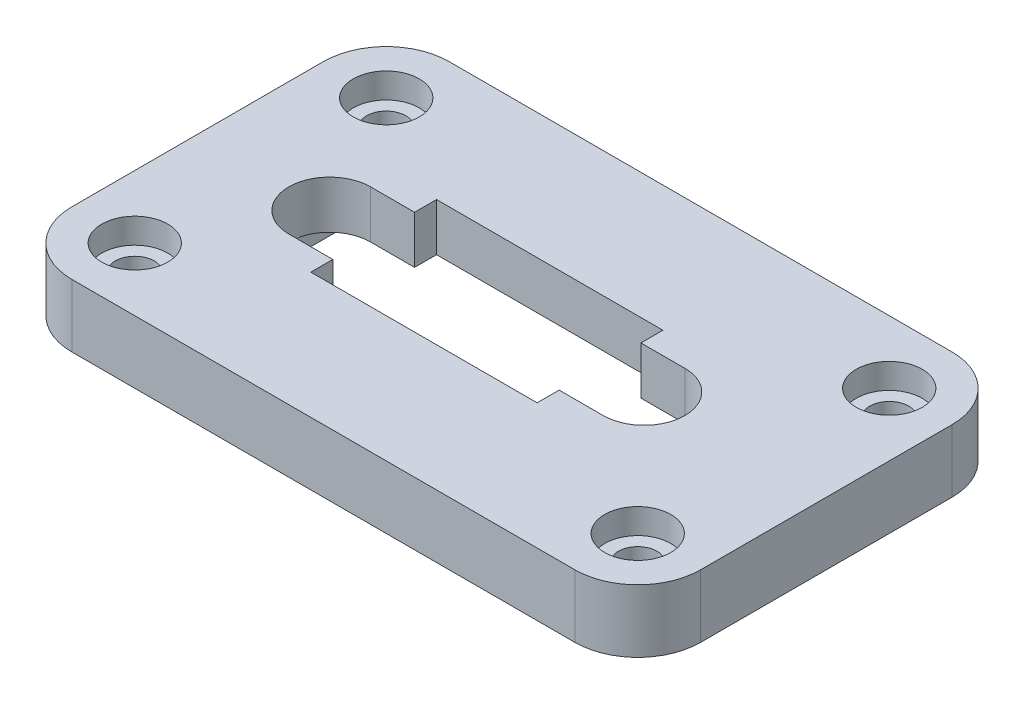
ISO-10303-21;
HEADER;
FILE_DESCRIPTION(('STEP AP214'),'2;1');
FILE_NAME('part.step','',(''),(''),'','','');
FILE_SCHEMA(('AUTOMOTIVE_DESIGN { 1 0 10303 214 1 1 1 1 }'));
ENDSEC;
DATA;
#1=APPLICATION_CONTEXT('core data for automotive mechanical design processes');
#2=APPLICATION_PROTOCOL_DEFINITION('international standard','automotive_design',2000,#1);
#3=PRODUCT_CONTEXT('',#1,'mechanical');
#4=PRODUCT('Part','Part','',(#3));
#5=PRODUCT_RELATED_PRODUCT_CATEGORY('part','',(#4));
#6=PRODUCT_DEFINITION_FORMATION('','',#4);
#7=PRODUCT_DEFINITION_CONTEXT('part definition',#1,'design');
#8=PRODUCT_DEFINITION('design','',#6,#7);
#9=PRODUCT_DEFINITION_SHAPE('','',#8);
#10=(LENGTH_UNIT() NAMED_UNIT(*) SI_UNIT(.MILLI.,.METRE.));
#11=(NAMED_UNIT(*) PLANE_ANGLE_UNIT() SI_UNIT($,.RADIAN.));
#12=(NAMED_UNIT(*) SI_UNIT($,.STERADIAN.) SOLID_ANGLE_UNIT());
#13=UNCERTAINTY_MEASURE_WITH_UNIT(LENGTH_MEASURE(1.E-05),#10,'distance_accuracy_value','');
#14=(GEOMETRIC_REPRESENTATION_CONTEXT(3) GLOBAL_UNCERTAINTY_ASSIGNED_CONTEXT((#13)) GLOBAL_UNIT_ASSIGNED_CONTEXT((#10,
#11,#12)) REPRESENTATION_CONTEXT('',''));
#15=CARTESIAN_POINT('',(0.,0.,0.));
#16=DIRECTION('',(0.,0.,1.));
#17=DIRECTION('',(1.,0.,0.));
#18=AXIS2_PLACEMENT_3D('',#15,#16,#17);
#19=CARTESIAN_POINT('',(10.5,5.,0.));
#20=DIRECTION('',(0.,-1.,0.));
#21=DIRECTION('',(0.,0.,-1.));
#22=AXIS2_PLACEMENT_3D('',#19,#20,#21);
#23=CYLINDRICAL_SURFACE('',#22,3.25);
#24=CARTESIAN_POINT('',(10.5,1.2,0.));
#25=DIRECTION('',(0.,-1.,0.));
#26=DIRECTION('',(0.,0.,-1.));
#27=AXIS2_PLACEMENT_3D('',#24,#25,#26);
#28=CIRCLE('',#27,3.25);
#29=CARTESIAN_POINT('',(10.5,1.2,-3.25));
#30=VERTEX_POINT('',#29);
#31=CARTESIAN_POINT('',(13.75,1.2,0.));
#32=VERTEX_POINT('',#31);
#33=EDGE_CURVE('E282',#30,#32,#28,.T.);
#34=ORIENTED_EDGE('',*,*,#33,.T.);
#35=CARTESIAN_POINT('',(10.5,1.2,3.25));
#36=VERTEX_POINT('',#35);
#37=EDGE_CURVE('E287',#32,#36,#28,.T.);
#38=ORIENTED_EDGE('',*,*,#37,.T.);
#39=DIRECTION('',(0.,-1.,0.));
#40=VECTOR('',#39,1.);
#41=CARTESIAN_POINT('',(10.5,5.,3.25));
#42=LINE('',#41,#40);
#43=CARTESIAN_POINT('',(10.5,5.,3.25));
#44=VERTEX_POINT('',#43);
#45=EDGE_CURVE('E470',#44,#36,#42,.T.);
#46=ORIENTED_EDGE('',*,*,#45,.F.);
#47=CARTESIAN_POINT('',(10.5,5.,0.));
#48=DIRECTION('',(0.,1.,0.));
#49=DIRECTION('',(0.,0.,1.));
#50=AXIS2_PLACEMENT_3D('',#47,#48,#49);
#51=CIRCLE('',#50,3.25);
#52=CARTESIAN_POINT('',(10.5,5.,-3.25));
#53=VERTEX_POINT('',#52);
#54=EDGE_CURVE('E339',#44,#53,#51,.T.);
#55=ORIENTED_EDGE('',*,*,#54,.T.);
#56=DIRECTION('',(0.,-1.,0.));
#57=VECTOR('',#56,1.);
#58=CARTESIAN_POINT('',(10.5,5.,-3.25));
#59=LINE('',#58,#57);
#60=EDGE_CURVE('E394',#53,#30,#59,.T.);
#61=ORIENTED_EDGE('',*,*,#60,.T.);
#62=EDGE_LOOP('',(#34,#38,#46,#55,#61));
#63=FACE_BOUND('',#62,.T.);
#64=ADVANCED_FACE('F41',(#63),#23,.F.);
#65=CARTESIAN_POINT('',(0.,5.,3.25));
#66=DIRECTION('',(0.,0.,1.));
#67=DIRECTION('',(1.,0.,0.));
#68=AXIS2_PLACEMENT_3D('',#65,#66,#67);
#69=PLANE('',#68);
#70=DIRECTION('',(1.,0.,0.));
#71=VECTOR('',#70,1.);
#72=CARTESIAN_POINT('',(0.,1.2,3.25));
#73=LINE('',#72,#71);
#74=CARTESIAN_POINT('',(7.,1.2,3.25));
#75=VERTEX_POINT('',#74);
#76=EDGE_CURVE('E303',#75,#36,#73,.T.);
#77=ORIENTED_EDGE('',*,*,#76,.F.);
#78=DIRECTION('',(0.,-1.,0.));
#79=VECTOR('',#78,1.);
#80=CARTESIAN_POINT('',(7.,5.,3.25));
#81=LINE('',#80,#79);
#82=CARTESIAN_POINT('',(7.,5.,3.25));
#83=VERTEX_POINT('',#82);
#84=EDGE_CURVE('E466',#83,#75,#81,.T.);
#85=ORIENTED_EDGE('',*,*,#84,.F.);
#86=DIRECTION('',(-1.,0.,0.));
#87=VECTOR('',#86,1.);
#88=CARTESIAN_POINT('',(0.,5.,3.25));
#89=LINE('',#88,#87);
#90=EDGE_CURVE('E343',#44,#83,#89,.T.);
#91=ORIENTED_EDGE('',*,*,#90,.F.);
#92=ORIENTED_EDGE('',*,*,#45,.T.);
#93=EDGE_LOOP('',(#77,#85,#91,#92));
#94=FACE_BOUND('',#93,.T.);
#95=ADVANCED_FACE('F578',(#94),#69,.F.);
#96=CARTESIAN_POINT('',(7.,5.,0.));
#97=DIRECTION('',(-1.,0.,0.));
#98=DIRECTION('',(0.,0.,1.));
#99=AXIS2_PLACEMENT_3D('',#96,#97,#98);
#100=PLANE('',#99);
#101=ORIENTED_EDGE('',*,*,#84,.T.);
#102=DIRECTION('',(0.,0.,1.));
#103=VECTOR('',#102,1.);
#104=CARTESIAN_POINT('',(7.,1.2,0.));
#105=LINE('',#104,#103);
#106=CARTESIAN_POINT('',(7.,1.2,5.));
#107=VERTEX_POINT('',#106);
#108=EDGE_CURVE('E299',#75,#107,#105,.T.);
#109=ORIENTED_EDGE('',*,*,#108,.T.);
#110=DIRECTION('',(0.,-1.,0.));
#111=VECTOR('',#110,1.);
#112=CARTESIAN_POINT('',(7.,5.,5.));
#113=LINE('',#112,#111);
#114=CARTESIAN_POINT('',(7.,5.,5.));
#115=VERTEX_POINT('',#114);
#116=EDGE_CURVE('E462',#115,#107,#113,.T.);
#117=ORIENTED_EDGE('',*,*,#116,.F.);
#118=DIRECTION('',(0.,0.,-1.));
#119=VECTOR('',#118,1.);
#120=CARTESIAN_POINT('',(7.,5.,0.));
#121=LINE('',#120,#119);
#122=EDGE_CURVE('E347',#115,#83,#121,.T.);
#123=ORIENTED_EDGE('',*,*,#122,.T.);
#124=EDGE_LOOP('',(#101,#109,#117,#123));
#125=FACE_BOUND('',#124,.T.);
#126=ADVANCED_FACE('F584',(#125),#100,.T.);
#127=CARTESIAN_POINT('',(0.,5.,5.));
#128=DIRECTION('',(0.,0.,-1.));
#129=DIRECTION('',(-1.,0.,0.));
#130=AXIS2_PLACEMENT_3D('',#127,#128,#129);
#131=PLANE('',#130);
#132=ORIENTED_EDGE('',*,*,#116,.T.);
#133=DIRECTION('',(-1.,0.,0.));
#134=VECTOR('',#133,1.);
#135=CARTESIAN_POINT('',(0.,1.2,5.));
#136=LINE('',#135,#134);
#137=CARTESIAN_POINT('',(-11.,1.2,5.));
#138=VERTEX_POINT('',#137);
#139=EDGE_CURVE('E295',#107,#138,#136,.T.);
#140=ORIENTED_EDGE('',*,*,#139,.T.);
#141=DIRECTION('',(0.,-1.,0.));
#142=VECTOR('',#141,1.);
#143=CARTESIAN_POINT('',(-11.,5.,5.));
#144=LINE('',#143,#142);
#145=CARTESIAN_POINT('',(-11.,5.,5.));
#146=VERTEX_POINT('',#145);
#147=EDGE_CURVE('E458',#146,#138,#144,.T.);
#148=ORIENTED_EDGE('',*,*,#147,.F.);
#149=DIRECTION('',(1.,0.,0.));
#150=VECTOR('',#149,1.);
#151=CARTESIAN_POINT('',(0.,5.,5.));
#152=LINE('',#151,#150);
#153=EDGE_CURVE('E351',#146,#115,#152,.T.);
#154=ORIENTED_EDGE('',*,*,#153,.T.);
#155=EDGE_LOOP('',(#132,#140,#148,#154));
#156=FACE_BOUND('',#155,.T.);
#157=ADVANCED_FACE('F698',(#156),#131,.T.);
#158=CARTESIAN_POINT('',(-11.,5.,0.));
#159=DIRECTION('',(-1.,0.,0.));
#160=DIRECTION('',(0.,0.,1.));
#161=AXIS2_PLACEMENT_3D('',#158,#159,#160);
#162=PLANE('',#161);
#163=DIRECTION('',(0.,0.,1.));
#164=VECTOR('',#163,1.);
#165=CARTESIAN_POINT('',(-11.,1.2,0.));
#166=LINE('',#165,#164);
#167=CARTESIAN_POINT('',(-11.,1.2,3.25));
#168=VERTEX_POINT('',#167);
#169=EDGE_CURVE('E292',#168,#138,#166,.T.);
#170=ORIENTED_EDGE('',*,*,#169,.F.);
#171=DIRECTION('',(0.,-1.,0.));
#172=VECTOR('',#171,1.);
#173=CARTESIAN_POINT('',(-11.,5.,3.25));
#174=LINE('',#173,#172);
#175=CARTESIAN_POINT('',(-11.,5.,3.25));
#176=VERTEX_POINT('',#175);
#177=EDGE_CURVE('E454',#176,#168,#174,.T.);
#178=ORIENTED_EDGE('',*,*,#177,.F.);
#179=DIRECTION('',(0.,0.,-1.));
#180=VECTOR('',#179,1.);
#181=CARTESIAN_POINT('',(-11.,5.,0.));
#182=LINE('',#181,#180);
#183=EDGE_CURVE('E356',#146,#176,#182,.T.);
#184=ORIENTED_EDGE('',*,*,#183,.F.);
#185=ORIENTED_EDGE('',*,*,#147,.T.);
#186=EDGE_LOOP('',(#170,#178,#184,#185));
#187=FACE_BOUND('',#186,.T.);
#188=ADVANCED_FACE('F708',(#187),#162,.F.);
#189=CARTESIAN_POINT('',(0.,5.,3.25));
#190=DIRECTION('',(0.,0.,-1.));
#191=DIRECTION('',(-1.,0.,0.));
#192=AXIS2_PLACEMENT_3D('',#189,#190,#191);
#193=PLANE('',#192);
#194=ORIENTED_EDGE('',*,*,#177,.T.);
#195=DIRECTION('',(-1.,0.,0.));
#196=VECTOR('',#195,1.);
#197=CARTESIAN_POINT('',(0.,1.2,3.25));
#198=LINE('',#197,#196);
#199=CARTESIAN_POINT('',(-14.5,1.2,3.25));
#200=VERTEX_POINT('',#199);
#201=EDGE_CURVE('E288',#168,#200,#198,.T.);
#202=ORIENTED_EDGE('',*,*,#201,.T.);
#203=DIRECTION('',(0.,-1.,0.));
#204=VECTOR('',#203,1.);
#205=CARTESIAN_POINT('',(-14.5,5.,3.25));
#206=LINE('',#205,#204);
#207=CARTESIAN_POINT('',(-14.5,5.,3.25));
#208=VERTEX_POINT('',#207);
#209=EDGE_CURVE('E450',#208,#200,#206,.T.);
#210=ORIENTED_EDGE('',*,*,#209,.F.);
#211=DIRECTION('',(1.,0.,0.));
#212=VECTOR('',#211,1.);
#213=CARTESIAN_POINT('',(0.,5.,3.25));
#214=LINE('',#213,#212);
#215=EDGE_CURVE('E359',#208,#176,#214,.T.);
#216=ORIENTED_EDGE('',*,*,#215,.T.);
#217=EDGE_LOOP('',(#194,#202,#210,#216));
#218=FACE_BOUND('',#217,.T.);
#219=ADVANCED_FACE('F716',(#218),#193,.T.);
#220=CARTESIAN_POINT('',(-14.5,5.,0.));
#221=DIRECTION('',(0.,-1.,0.));
#222=DIRECTION('',(0.,0.,-1.));
#223=AXIS2_PLACEMENT_3D('',#220,#221,#222);
#224=CYLINDRICAL_SURFACE('',#223,3.25);
#225=CARTESIAN_POINT('',(-14.5,1.2,0.));
#226=DIRECTION('',(0.,-1.,0.));
#227=DIRECTION('',(0.,0.,-1.));
#228=AXIS2_PLACEMENT_3D('',#225,#226,#227);
#229=CIRCLE('',#228,3.25);
#230=CARTESIAN_POINT('',(-17.75,1.2,0.));
#231=VERTEX_POINT('',#230);
#232=EDGE_CURVE('E283',#200,#231,#229,.T.);
#233=ORIENTED_EDGE('',*,*,#232,.T.);
#234=CARTESIAN_POINT('',(-14.5,1.2,-3.25));
#235=VERTEX_POINT('',#234);
#236=EDGE_CURVE('E217',#231,#235,#229,.T.);
#237=ORIENTED_EDGE('',*,*,#236,.T.);
#238=DIRECTION('',(0.,-1.,0.));
#239=VECTOR('',#238,1.);
#240=CARTESIAN_POINT('',(-14.5,5.,-3.25));
#241=LINE('',#240,#239);
#242=CARTESIAN_POINT('',(-14.5,5.,-3.25));
#243=VERTEX_POINT('',#242);
#244=EDGE_CURVE('E446',#243,#235,#241,.T.);
#245=ORIENTED_EDGE('',*,*,#244,.F.);
#246=CARTESIAN_POINT('',(-14.5,5.,0.));
#247=DIRECTION('',(0.,1.,0.));
#248=DIRECTION('',(0.,0.,1.));
#249=AXIS2_PLACEMENT_3D('',#246,#247,#248);
#250=CIRCLE('',#249,3.25);
#251=EDGE_CURVE('E364',#243,#208,#250,.T.);
#252=ORIENTED_EDGE('',*,*,#251,.T.);
#253=ORIENTED_EDGE('',*,*,#209,.T.);
#254=EDGE_LOOP('',(#233,#237,#245,#252,#253));
#255=FACE_BOUND('',#254,.T.);
#256=ADVANCED_FACE('F726',(#255),#224,.F.);
#257=CARTESIAN_POINT('',(0.,5.,-3.25));
#258=DIRECTION('',(0.,0.,-1.));
#259=DIRECTION('',(-1.,0.,0.));
#260=AXIS2_PLACEMENT_3D('',#257,#258,#259);
#261=PLANE('',#260);
#262=DIRECTION('',(-1.,0.,0.));
#263=VECTOR('',#262,1.);
#264=CARTESIAN_POINT('',(0.,1.2,-3.25));
#265=LINE('',#264,#263);
#266=CARTESIAN_POINT('',(-11.,1.2,-3.25));
#267=VERTEX_POINT('',#266);
#268=EDGE_CURVE('E277',#267,#235,#265,.T.);
#269=ORIENTED_EDGE('',*,*,#268,.F.);
#270=DIRECTION('',(0.,-1.,0.));
#271=VECTOR('',#270,1.);
#272=CARTESIAN_POINT('',(-11.,5.,-3.25));
#273=LINE('',#272,#271);
#274=CARTESIAN_POINT('',(-11.,5.,-3.25));
#275=VERTEX_POINT('',#274);
#276=EDGE_CURVE('E442',#275,#267,#273,.T.);
#277=ORIENTED_EDGE('',*,*,#276,.F.);
#278=DIRECTION('',(1.,0.,0.));
#279=VECTOR('',#278,1.);
#280=CARTESIAN_POINT('',(0.,5.,-3.25));
#281=LINE('',#280,#279);
#282=EDGE_CURVE('E368',#243,#275,#281,.T.);
#283=ORIENTED_EDGE('',*,*,#282,.F.);
#284=ORIENTED_EDGE('',*,*,#244,.T.);
#285=EDGE_LOOP('',(#269,#277,#283,#284));
#286=FACE_BOUND('',#285,.T.);
#287=ADVANCED_FACE('F735',(#286),#261,.F.);
#288=DIRECTION('',(0.,0.,1.));
#289=VECTOR('',#288,1.);
#290=CARTESIAN_POINT('',(-11.,1.2,0.));
#291=LINE('',#290,#289);
#292=CARTESIAN_POINT('',(-11.,1.2,-5.));
#293=VERTEX_POINT('',#292);
#294=EDGE_CURVE('E274',#293,#267,#291,.T.);
#295=ORIENTED_EDGE('',*,*,#294,.F.);
#296=DIRECTION('',(0.,-1.,0.));
#297=VECTOR('',#296,1.);
#298=CARTESIAN_POINT('',(-11.,5.,-5.));
#299=LINE('',#298,#297);
#300=CARTESIAN_POINT('',(-11.,5.,-5.));
#301=VERTEX_POINT('',#300);
#302=EDGE_CURVE('E438',#301,#293,#299,.T.);
#303=ORIENTED_EDGE('',*,*,#302,.F.);
#304=EDGE_CURVE('E360',#275,#301,#182,.T.);
#305=ORIENTED_EDGE('',*,*,#304,.F.);
#306=ORIENTED_EDGE('',*,*,#276,.T.);
#307=EDGE_LOOP('',(#295,#303,#305,#306));
#308=FACE_BOUND('',#307,.T.);
#309=ADVANCED_FACE('F719',(#308),#162,.F.);
#310=CARTESIAN_POINT('',(0.,5.,-5.));
#311=DIRECTION('',(0.,0.,-1.));
#312=DIRECTION('',(-1.,0.,0.));
#313=AXIS2_PLACEMENT_3D('',#310,#311,#312);
#314=PLANE('',#313);
#315=DIRECTION('',(-1.,0.,0.));
#316=VECTOR('',#315,1.);
#317=CARTESIAN_POINT('',(0.,1.2,-5.));
#318=LINE('',#317,#316);
#319=CARTESIAN_POINT('',(7.,1.2,-5.));
#320=VERTEX_POINT('',#319);
#321=EDGE_CURVE('E271',#320,#293,#318,.T.);
#322=ORIENTED_EDGE('',*,*,#321,.F.);
#323=DIRECTION('',(0.,-1.,0.));
#324=VECTOR('',#323,1.);
#325=CARTESIAN_POINT('',(7.,5.,-5.));
#326=LINE('',#325,#324);
#327=CARTESIAN_POINT('',(7.,5.,-5.));
#328=VERTEX_POINT('',#327);
#329=EDGE_CURVE('E434',#328,#320,#326,.T.);
#330=ORIENTED_EDGE('',*,*,#329,.F.);
#331=DIRECTION('',(1.,0.,0.));
#332=VECTOR('',#331,1.);
#333=CARTESIAN_POINT('',(0.,5.,-5.));
#334=LINE('',#333,#332);
#335=EDGE_CURVE('E372',#301,#328,#334,.T.);
#336=ORIENTED_EDGE('',*,*,#335,.F.);
#337=ORIENTED_EDGE('',*,*,#302,.T.);
#338=EDGE_LOOP('',(#322,#330,#336,#337));
#339=FACE_BOUND('',#338,.T.);
#340=ADVANCED_FACE('F752',(#339),#314,.F.);
#341=ORIENTED_EDGE('',*,*,#329,.T.);
#342=DIRECTION('',(0.,0.,1.));
#343=VECTOR('',#342,1.);
#344=CARTESIAN_POINT('',(7.,1.2,0.));
#345=LINE('',#344,#343);
#346=CARTESIAN_POINT('',(7.,1.2,-3.25));
#347=VERTEX_POINT('',#346);
#348=EDGE_CURVE('E261',#320,#347,#345,.T.);
#349=ORIENTED_EDGE('',*,*,#348,.T.);
#350=DIRECTION('',(0.,-1.,0.));
#351=VECTOR('',#350,1.);
#352=CARTESIAN_POINT('',(7.,5.,-3.25));
#353=LINE('',#352,#351);
#354=CARTESIAN_POINT('',(7.,5.,-3.25));
#355=VERTEX_POINT('',#354);
#356=EDGE_CURVE('E430',#355,#347,#353,.T.);
#357=ORIENTED_EDGE('',*,*,#356,.F.);
#358=EDGE_CURVE('E352',#355,#328,#121,.T.);
#359=ORIENTED_EDGE('',*,*,#358,.T.);
#360=EDGE_LOOP('',(#341,#349,#357,#359));
#361=FACE_BOUND('',#360,.T.);
#362=ADVANCED_FACE('F701',(#361),#100,.T.);
#363=CARTESIAN_POINT('',(0.,5.,-3.25));
#364=DIRECTION('',(0.,0.,1.));
#365=DIRECTION('',(1.,0.,0.));
#366=AXIS2_PLACEMENT_3D('',#363,#364,#365);
#367=PLANE('',#366);
#368=ORIENTED_EDGE('',*,*,#356,.T.);
#369=DIRECTION('',(1.,0.,0.));
#370=VECTOR('',#369,1.);
#371=CARTESIAN_POINT('',(0.,1.2,-3.25));
#372=LINE('',#371,#370);
#373=EDGE_CURVE('E493',#347,#30,#372,.T.);
#374=ORIENTED_EDGE('',*,*,#373,.T.);
#375=ORIENTED_EDGE('',*,*,#60,.F.);
#376=DIRECTION('',(-1.,0.,0.));
#377=VECTOR('',#376,1.);
#378=CARTESIAN_POINT('',(0.,5.,-3.25));
#379=LINE('',#378,#377);
#380=EDGE_CURVE('E375',#53,#355,#379,.T.);
#381=ORIENTED_EDGE('',*,*,#380,.T.);
#382=EDGE_LOOP('',(#368,#374,#375,#381));
#383=FACE_BOUND('',#382,.T.);
#384=ADVANCED_FACE('F593',(#383),#367,.T.);
#385=CARTESIAN_POINT('',(-20.,5.,-10.));
#386=DIRECTION('',(0.,-1.,0.));
#387=DIRECTION('',(0.,0.,-1.));
#388=AXIS2_PLACEMENT_3D('',#385,#386,#387);
#389=CYLINDRICAL_SURFACE('',#388,1.55);
#390=CARTESIAN_POINT('',(-20.,0.,-10.));
#391=DIRECTION('',(0.,1.,0.));
#392=DIRECTION('',(0.,0.,1.));
#393=AXIS2_PLACEMENT_3D('',#390,#391,#392);
#394=CIRCLE('',#393,1.55);
#395=CARTESIAN_POINT('',(-20.,0.,-8.45));
#396=VERTEX_POINT('',#395);
#397=EDGE_CURVE('E408',#396,#396,#394,.T.);
#398=ORIENTED_EDGE('',*,*,#397,.F.);
#399=EDGE_LOOP('',(#398));
#400=FACE_BOUND('',#399,.T.);
#401=CARTESIAN_POINT('',(-20.,3.,-10.));
#402=DIRECTION('',(0.,1.,0.));
#403=DIRECTION('',(0.,0.,1.));
#404=AXIS2_PLACEMENT_3D('',#401,#402,#403);
#405=CIRCLE('',#404,1.55);
#406=CARTESIAN_POINT('',(-20.,3.,-8.45));
#407=VERTEX_POINT('',#406);
#408=EDGE_CURVE('E400',#407,#407,#405,.T.);
#409=ORIENTED_EDGE('',*,*,#408,.T.);
#410=EDGE_LOOP('',(#409));
#411=FACE_BOUND('',#410,.T.);
#412=ADVANCED_FACE('F589',(#400,#411),#389,.F.);
#413=CARTESIAN_POINT('',(-20.,5.,10.));
#414=DIRECTION('',(0.,-1.,0.));
#415=DIRECTION('',(0.,0.,-1.));
#416=AXIS2_PLACEMENT_3D('',#413,#414,#415);
#417=CYLINDRICAL_SURFACE('',#416,1.55);
#418=CARTESIAN_POINT('',(-20.,0.,10.));
#419=DIRECTION('',(0.,1.,0.));
#420=DIRECTION('',(0.,0.,1.));
#421=AXIS2_PLACEMENT_3D('',#418,#419,#420);
#422=CIRCLE('',#421,1.55);
#423=CARTESIAN_POINT('',(-20.,0.,11.55));
#424=VERTEX_POINT('',#423);
#425=EDGE_CURVE('E404',#424,#424,#422,.T.);
#426=ORIENTED_EDGE('',*,*,#425,.F.);
#427=EDGE_LOOP('',(#426));
#428=FACE_BOUND('',#427,.T.);
#429=CARTESIAN_POINT('',(-20.,3.,10.));
#430=DIRECTION('',(0.,1.,0.));
#431=DIRECTION('',(0.,0.,1.));
#432=AXIS2_PLACEMENT_3D('',#429,#430,#431);
#433=CIRCLE('',#432,1.55);
#434=CARTESIAN_POINT('',(-20.,3.,11.55));
#435=VERTEX_POINT('',#434);
#436=EDGE_CURVE('E482',#435,#435,#433,.T.);
#437=ORIENTED_EDGE('',*,*,#436,.T.);
#438=EDGE_LOOP('',(#437));
#439=FACE_BOUND('',#438,.T.);
#440=ADVANCED_FACE('F592',(#428,#439),#417,.F.);
#441=CARTESIAN_POINT('',(20.,5.,10.));
#442=DIRECTION('',(0.,-1.,0.));
#443=DIRECTION('',(0.,0.,-1.));
#444=AXIS2_PLACEMENT_3D('',#441,#442,#443);
#445=CYLINDRICAL_SURFACE('',#444,1.55);
#446=CARTESIAN_POINT('',(20.,0.,10.));
#447=DIRECTION('',(0.,1.,0.));
#448=DIRECTION('',(0.,0.,1.));
#449=AXIS2_PLACEMENT_3D('',#446,#447,#448);
#450=CIRCLE('',#449,1.55);
#451=CARTESIAN_POINT('',(20.,0.,11.55));
#452=VERTEX_POINT('',#451);
#453=EDGE_CURVE('E399',#452,#452,#450,.T.);
#454=ORIENTED_EDGE('',*,*,#453,.F.);
#455=EDGE_LOOP('',(#454));
#456=FACE_BOUND('',#455,.T.);
#457=CARTESIAN_POINT('',(20.,3.,10.));
#458=DIRECTION('',(0.,1.,0.));
#459=DIRECTION('',(0.,0.,1.));
#460=AXIS2_PLACEMENT_3D('',#457,#458,#459);
#461=CIRCLE('',#460,1.55);
#462=CARTESIAN_POINT('',(20.,3.,11.55));
#463=VERTEX_POINT('',#462);
#464=EDGE_CURVE('E478',#463,#463,#461,.T.);
#465=ORIENTED_EDGE('',*,*,#464,.T.);
#466=EDGE_LOOP('',(#465));
#467=FACE_BOUND('',#466,.T.);
#468=ADVANCED_FACE('F597',(#456,#467),#445,.F.);
#469=CARTESIAN_POINT('',(20.,5.,-10.));
#470=DIRECTION('',(0.,-1.,0.));
#471=DIRECTION('',(0.,0.,-1.));
#472=AXIS2_PLACEMENT_3D('',#469,#470,#471);
#473=CYLINDRICAL_SURFACE('',#472,1.55);
#474=CARTESIAN_POINT('',(20.,0.,-10.));
#475=DIRECTION('',(0.,1.,0.));
#476=DIRECTION('',(0.,0.,1.));
#477=AXIS2_PLACEMENT_3D('',#474,#475,#476);
#478=CIRCLE('',#477,1.55);
#479=CARTESIAN_POINT('',(20.,0.,-8.45));
#480=VERTEX_POINT('',#479);
#481=EDGE_CURVE('E395',#480,#480,#478,.T.);
#482=ORIENTED_EDGE('',*,*,#481,.F.);
#483=EDGE_LOOP('',(#482));
#484=FACE_BOUND('',#483,.T.);
#485=CARTESIAN_POINT('',(20.,3.,-10.));
#486=DIRECTION('',(0.,1.,0.));
#487=DIRECTION('',(0.,0.,1.));
#488=AXIS2_PLACEMENT_3D('',#485,#486,#487);
#489=CIRCLE('',#488,1.55);
#490=CARTESIAN_POINT('',(20.,3.,-8.45));
#491=VERTEX_POINT('',#490);
#492=EDGE_CURVE('E335',#491,#491,#489,.T.);
#493=ORIENTED_EDGE('',*,*,#492,.T.);
#494=EDGE_LOOP('',(#493));
#495=FACE_BOUND('',#494,.T.);
#496=ADVANCED_FACE('F601',(#484,#495),#473,.F.);
#497=CARTESIAN_POINT('',(0.,5.,15.));
#498=DIRECTION('',(0.,0.,-1.));
#499=DIRECTION('',(-1.,0.,0.));
#500=AXIS2_PLACEMENT_3D('',#497,#498,#499);
#501=PLANE('',#500);
#502=DIRECTION('',(1.,0.,0.));
#503=VECTOR('',#502,1.);
#504=CARTESIAN_POINT('',(0.,0.,15.));
#505=LINE('',#504,#503);
#506=CARTESIAN_POINT('',(-20.,0.,15.));
#507=VERTEX_POINT('',#506);
#508=CARTESIAN_POINT('',(20.,0.,15.));
#509=VERTEX_POINT('',#508);
#510=EDGE_CURVE('E412',#507,#509,#505,.T.);
#511=ORIENTED_EDGE('',*,*,#510,.T.);
#512=DIRECTION('',(0.,-1.,0.));
#513=VECTOR('',#512,1.);
#514=CARTESIAN_POINT('',(20.,5.,15.));
#515=LINE('',#514,#513);
#516=CARTESIAN_POINT('',(20.,5.,15.));
#517=VERTEX_POINT('',#516);
#518=EDGE_CURVE('E520',#509,#517,#515,.F.);
#519=ORIENTED_EDGE('',*,*,#518,.T.);
#520=DIRECTION('',(1.,0.,0.));
#521=VECTOR('',#520,1.);
#522=CARTESIAN_POINT('',(0.,5.,15.));
#523=LINE('',#522,#521);
#524=CARTESIAN_POINT('',(-20.,5.,15.));
#525=VERTEX_POINT('',#524);
#526=EDGE_CURVE('E379',#525,#517,#523,.T.);
#527=ORIENTED_EDGE('',*,*,#526,.F.);
#528=DIRECTION('',(0.,-1.,0.));
#529=VECTOR('',#528,1.);
#530=CARTESIAN_POINT('',(-20.,0.,15.));
#531=LINE('',#530,#529);
#532=EDGE_CURVE('E516',#525,#507,#531,.T.);
#533=ORIENTED_EDGE('',*,*,#532,.T.);
#534=EDGE_LOOP('',(#511,#519,#527,#533));
#535=FACE_BOUND('',#534,.T.);
#536=ADVANCED_FACE('F563',(#535),#501,.F.);
#537=CARTESIAN_POINT('',(25.,5.,0.));
#538=DIRECTION('',(-1.,0.,0.));
#539=DIRECTION('',(0.,0.,1.));
#540=AXIS2_PLACEMENT_3D('',#537,#538,#539);
#541=PLANE('',#540);
#542=DIRECTION('',(0.,0.,-1.));
#543=VECTOR('',#542,1.);
#544=CARTESIAN_POINT('',(25.,5.,0.));
#545=LINE('',#544,#543);
#546=CARTESIAN_POINT('',(25.,5.,10.));
#547=VERTEX_POINT('',#546);
#548=CARTESIAN_POINT('',(25.,5.,-10.));
#549=VERTEX_POINT('',#548);
#550=EDGE_CURVE('E383',#547,#549,#545,.T.);
#551=ORIENTED_EDGE('',*,*,#550,.F.);
#552=DIRECTION('',(0.,-1.,0.));
#553=VECTOR('',#552,1.);
#554=CARTESIAN_POINT('',(25.,5.,10.));
#555=LINE('',#554,#553);
#556=CARTESIAN_POINT('',(25.,0.,10.));
#557=VERTEX_POINT('',#556);
#558=EDGE_CURVE('E500',#547,#557,#555,.T.);
#559=ORIENTED_EDGE('',*,*,#558,.T.);
#560=DIRECTION('',(0.,0.,-1.));
#561=VECTOR('',#560,1.);
#562=CARTESIAN_POINT('',(25.,0.,0.));
#563=LINE('',#562,#561);
#564=CARTESIAN_POINT('',(25.,0.,-10.));
#565=VERTEX_POINT('',#564);
#566=EDGE_CURVE('E416',#557,#565,#563,.T.);
#567=ORIENTED_EDGE('',*,*,#566,.T.);
#568=DIRECTION('',(0.,-1.,0.));
#569=VECTOR('',#568,1.);
#570=CARTESIAN_POINT('',(25.,5.,-10.));
#571=LINE('',#570,#569);
#572=EDGE_CURVE('E497',#565,#549,#571,.F.);
#573=ORIENTED_EDGE('',*,*,#572,.T.);
#574=EDGE_LOOP('',(#551,#559,#567,#573));
#575=FACE_BOUND('',#574,.T.);
#576=ADVANCED_FACE('F571',(#575),#541,.F.);
#577=CARTESIAN_POINT('',(0.,5.,-15.));
#578=DIRECTION('',(0.,0.,-1.));
#579=DIRECTION('',(-1.,0.,0.));
#580=AXIS2_PLACEMENT_3D('',#577,#578,#579);
#581=PLANE('',#580);
#582=DIRECTION('',(1.,0.,0.));
#583=VECTOR('',#582,1.);
#584=CARTESIAN_POINT('',(0.,0.,-15.));
#585=LINE('',#584,#583);
#586=CARTESIAN_POINT('',(-20.,0.,-15.));
#587=VERTEX_POINT('',#586);
#588=CARTESIAN_POINT('',(20.,0.,-15.));
#589=VERTEX_POINT('',#588);
#590=EDGE_CURVE('E420',#587,#589,#585,.T.);
#591=ORIENTED_EDGE('',*,*,#590,.F.);
#592=DIRECTION('',(0.,-1.,0.));
#593=VECTOR('',#592,1.);
#594=CARTESIAN_POINT('',(-20.,5.,-15.));
#595=LINE('',#594,#593);
#596=CARTESIAN_POINT('',(-20.,5.,-15.));
#597=VERTEX_POINT('',#596);
#598=EDGE_CURVE('E11',#587,#597,#595,.F.);
#599=ORIENTED_EDGE('',*,*,#598,.T.);
#600=DIRECTION('',(1.,0.,0.));
#601=VECTOR('',#600,1.);
#602=CARTESIAN_POINT('',(0.,5.,-15.));
#603=LINE('',#602,#601);
#604=CARTESIAN_POINT('',(20.,5.,-15.));
#605=VERTEX_POINT('',#604);
#606=EDGE_CURVE('E387',#597,#605,#603,.T.);
#607=ORIENTED_EDGE('',*,*,#606,.T.);
#608=DIRECTION('',(0.,-1.,0.));
#609=VECTOR('',#608,1.);
#610=CARTESIAN_POINT('',(20.,0.,-15.));
#611=LINE('',#610,#609);
#612=EDGE_CURVE('E50',#605,#589,#611,.T.);
#613=ORIENTED_EDGE('',*,*,#612,.T.);
#614=EDGE_LOOP('',(#591,#599,#607,#613));
#615=FACE_BOUND('',#614,.T.);
#616=ADVANCED_FACE('F544',(#615),#581,.T.);
#617=CARTESIAN_POINT('',(-25.,5.,0.));
#618=DIRECTION('',(-1.,0.,0.));
#619=DIRECTION('',(0.,0.,1.));
#620=AXIS2_PLACEMENT_3D('',#617,#618,#619);
#621=PLANE('',#620);
#622=DIRECTION('',(0.,0.,-1.));
#623=VECTOR('',#622,1.);
#624=CARTESIAN_POINT('',(-25.,0.,0.));
#625=LINE('',#624,#623);
#626=CARTESIAN_POINT('',(-25.,0.,10.));
#627=VERTEX_POINT('',#626);
#628=CARTESIAN_POINT('',(-25.,0.,-10.));
#629=VERTEX_POINT('',#628);
#630=EDGE_CURVE('E344',#627,#629,#625,.T.);
#631=ORIENTED_EDGE('',*,*,#630,.F.);
#632=DIRECTION('',(0.,-1.,0.));
#633=VECTOR('',#632,1.);
#634=CARTESIAN_POINT('',(-25.,5.,10.));
#635=LINE('',#634,#633);
#636=CARTESIAN_POINT('',(-25.,5.,10.));
#637=VERTEX_POINT('',#636);
#638=EDGE_CURVE('E64',#627,#637,#635,.F.);
#639=ORIENTED_EDGE('',*,*,#638,.T.);
#640=DIRECTION('',(0.,0.,-1.));
#641=VECTOR('',#640,1.);
#642=CARTESIAN_POINT('',(-25.,5.,0.));
#643=LINE('',#642,#641);
#644=CARTESIAN_POINT('',(-25.,5.,-10.));
#645=VERTEX_POINT('',#644);
#646=EDGE_CURVE('E391',#637,#645,#643,.T.);
#647=ORIENTED_EDGE('',*,*,#646,.T.);
#648=DIRECTION('',(0.,-1.,0.));
#649=VECTOR('',#648,1.);
#650=CARTESIAN_POINT('',(-25.,5.,-10.));
#651=LINE('',#650,#649);
#652=EDGE_CURVE('E534',#645,#629,#651,.T.);
#653=ORIENTED_EDGE('',*,*,#652,.T.);
#654=EDGE_LOOP('',(#631,#639,#647,#653));
#655=FACE_BOUND('',#654,.T.);
#656=ADVANCED_FACE('F554',(#655),#621,.T.);
#657=CARTESIAN_POINT('',(0.,5.,0.));
#658=DIRECTION('',(0.,1.,0.));
#659=DIRECTION('',(0.,0.,1.));
#660=AXIS2_PLACEMENT_3D('',#657,#658,#659);
#661=PLANE('',#660);
#662=CARTESIAN_POINT('',(-20.,5.,10.));
#663=DIRECTION('',(0.,1.,0.));
#664=DIRECTION('',(0.,0.,1.));
#665=AXIS2_PLACEMENT_3D('',#662,#663,#664);
#666=CIRCLE('',#665,2.625);
#667=CARTESIAN_POINT('',(-20.,5.,12.625));
#668=VERTEX_POINT('',#667);
#669=EDGE_CURVE('E306',#668,#668,#666,.T.);
#670=ORIENTED_EDGE('',*,*,#669,.F.);
#671=EDGE_LOOP('',(#670));
#672=FACE_BOUND('',#671,.T.);
#673=CARTESIAN_POINT('',(20.,5.,10.));
#674=DIRECTION('',(0.,1.,0.));
#675=DIRECTION('',(0.,0.,1.));
#676=AXIS2_PLACEMENT_3D('',#673,#674,#675);
#677=CIRCLE('',#676,2.625);
#678=CARTESIAN_POINT('',(20.,5.,12.625));
#679=VERTEX_POINT('',#678);
#680=EDGE_CURVE('E320',#679,#679,#677,.T.);
#681=ORIENTED_EDGE('',*,*,#680,.F.);
#682=EDGE_LOOP('',(#681));
#683=FACE_BOUND('',#682,.T.);
#684=CARTESIAN_POINT('',(20.,5.,-10.));
#685=DIRECTION('',(0.,1.,0.));
#686=DIRECTION('',(0.,0.,1.));
#687=AXIS2_PLACEMENT_3D('',#684,#685,#686);
#688=CIRCLE('',#687,2.625);
#689=CARTESIAN_POINT('',(20.,5.,-7.375));
#690=VERTEX_POINT('',#689);
#691=EDGE_CURVE('E312',#690,#690,#688,.T.);
#692=ORIENTED_EDGE('',*,*,#691,.F.);
#693=EDGE_LOOP('',(#692));
#694=FACE_BOUND('',#693,.T.);
#695=CARTESIAN_POINT('',(-20.,5.,-10.));
#696=DIRECTION('',(0.,1.,0.));
#697=DIRECTION('',(0.,0.,1.));
#698=AXIS2_PLACEMENT_3D('',#695,#696,#697);
#699=CIRCLE('',#698,2.625);
#700=CARTESIAN_POINT('',(-20.,5.,-7.375));
#701=VERTEX_POINT('',#700);
#702=EDGE_CURVE('E311',#701,#701,#699,.T.);
#703=ORIENTED_EDGE('',*,*,#702,.F.);
#704=EDGE_LOOP('',(#703));
#705=FACE_BOUND('',#704,.T.);
#706=ORIENTED_EDGE('',*,*,#54,.F.);
#707=ORIENTED_EDGE('',*,*,#90,.T.);
#708=ORIENTED_EDGE('',*,*,#122,.F.);
#709=ORIENTED_EDGE('',*,*,#153,.F.);
#710=ORIENTED_EDGE('',*,*,#183,.T.);
#711=ORIENTED_EDGE('',*,*,#215,.F.);
#712=ORIENTED_EDGE('',*,*,#251,.F.);
#713=ORIENTED_EDGE('',*,*,#282,.T.);
#714=ORIENTED_EDGE('',*,*,#304,.T.);
#715=ORIENTED_EDGE('',*,*,#335,.T.);
#716=ORIENTED_EDGE('',*,*,#358,.F.);
#717=ORIENTED_EDGE('',*,*,#380,.F.);
#718=EDGE_LOOP('',(#706,#707,#708,#709,#710,#711,#712,#713,#714,#715,#716,#717));
#719=FACE_BOUND('',#718,.T.);
#720=ORIENTED_EDGE('',*,*,#526,.T.);
#721=CARTESIAN_POINT('',(20.,5.,10.));
#722=DIRECTION('',(0.,1.,0.));
#723=DIRECTION('',(0.,0.,1.));
#724=AXIS2_PLACEMENT_3D('',#721,#722,#723);
#725=CIRCLE('',#724,5.);
#726=EDGE_CURVE('E531',#517,#547,#725,.T.);
#727=ORIENTED_EDGE('',*,*,#726,.T.);
#728=ORIENTED_EDGE('',*,*,#550,.T.);
#729=CARTESIAN_POINT('',(20.,5.,-10.));
#730=DIRECTION('',(0.,1.,0.));
#731=DIRECTION('',(0.,0.,1.));
#732=AXIS2_PLACEMENT_3D('',#729,#730,#731);
#733=CIRCLE('',#732,5.);
#734=EDGE_CURVE('E523',#549,#605,#733,.T.);
#735=ORIENTED_EDGE('',*,*,#734,.T.);
#736=ORIENTED_EDGE('',*,*,#606,.F.);
#737=CARTESIAN_POINT('',(-20.,5.,-10.));
#738=DIRECTION('',(0.,1.,0.));
#739=DIRECTION('',(0.,0.,1.));
#740=AXIS2_PLACEMENT_3D('',#737,#738,#739);
#741=CIRCLE('',#740,5.);
#742=EDGE_CURVE('E57',#597,#645,#741,.T.);
#743=ORIENTED_EDGE('',*,*,#742,.T.);
#744=ORIENTED_EDGE('',*,*,#646,.F.);
#745=CARTESIAN_POINT('',(-20.,5.,10.));
#746=DIRECTION('',(0.,1.,0.));
#747=DIRECTION('',(0.,0.,1.));
#748=AXIS2_PLACEMENT_3D('',#745,#746,#747);
#749=CIRCLE('',#748,5.);
#750=EDGE_CURVE('E528',#637,#525,#749,.T.);
#751=ORIENTED_EDGE('',*,*,#750,.T.);
#752=EDGE_LOOP('',(#720,#727,#728,#735,#736,#743,#744,#751));
#753=FACE_BOUND('',#752,.T.);
#754=ADVANCED_FACE('F556',(#672,#683,#694,#705,#719,#753),#661,.T.);
#755=CARTESIAN_POINT('',(0.,0.,0.));
#756=DIRECTION('',(0.,1.,0.));
#757=DIRECTION('',(0.,0.,1.));
#758=AXIS2_PLACEMENT_3D('',#755,#756,#757);
#759=PLANE('',#758);
#760=ORIENTED_EDGE('',*,*,#481,.T.);
#761=EDGE_LOOP('',(#760));
#762=FACE_BOUND('',#761,.T.);
#763=ORIENTED_EDGE('',*,*,#453,.T.);
#764=EDGE_LOOP('',(#763));
#765=FACE_BOUND('',#764,.T.);
#766=ORIENTED_EDGE('',*,*,#425,.T.);
#767=EDGE_LOOP('',(#766));
#768=FACE_BOUND('',#767,.T.);
#769=ORIENTED_EDGE('',*,*,#397,.T.);
#770=EDGE_LOOP('',(#769));
#771=FACE_BOUND('',#770,.T.);
#772=DIRECTION('',(1.,0.,0.));
#773=VECTOR('',#772,1.);
#774=CARTESIAN_POINT('',(13.75,0.,-6.5));
#775=LINE('',#774,#773);
#776=CARTESIAN_POINT('',(-17.75,0.,-6.5));
#777=VERTEX_POINT('',#776);
#778=CARTESIAN_POINT('',(13.75,0.,-6.5));
#779=VERTEX_POINT('',#778);
#780=EDGE_CURVE('E252',#777,#779,#775,.T.);
#781=ORIENTED_EDGE('',*,*,#780,.F.);
#782=DIRECTION('',(0.,0.,1.));
#783=VECTOR('',#782,1.);
#784=CARTESIAN_POINT('',(-17.75,0.,0.));
#785=LINE('',#784,#783);
#786=CARTESIAN_POINT('',(-17.75,0.,6.5));
#787=VERTEX_POINT('',#786);
#788=EDGE_CURVE('E229',#777,#787,#785,.T.);
#789=ORIENTED_EDGE('',*,*,#788,.T.);
#790=DIRECTION('',(-1.,0.,0.));
#791=VECTOR('',#790,1.);
#792=CARTESIAN_POINT('',(13.75,0.,6.5));
#793=LINE('',#792,#791);
#794=CARTESIAN_POINT('',(13.75,0.,6.5));
#795=VERTEX_POINT('',#794);
#796=EDGE_CURVE('E223',#795,#787,#793,.T.);
#797=ORIENTED_EDGE('',*,*,#796,.F.);
#798=DIRECTION('',(0.,0.,-1.));
#799=VECTOR('',#798,1.);
#800=CARTESIAN_POINT('',(13.75,0.,0.));
#801=LINE('',#800,#799);
#802=EDGE_CURVE('E474',#795,#779,#801,.T.);
#803=ORIENTED_EDGE('',*,*,#802,.T.);
#804=EDGE_LOOP('',(#781,#789,#797,#803));
#805=FACE_BOUND('',#804,.T.);
#806=ORIENTED_EDGE('',*,*,#566,.F.);
#807=CARTESIAN_POINT('',(20.,0.,10.));
#808=DIRECTION('',(0.,1.,0.));
#809=DIRECTION('',(0.,0.,1.));
#810=AXIS2_PLACEMENT_3D('',#807,#808,#809);
#811=CIRCLE('',#810,5.);
#812=EDGE_CURVE('E513',#557,#509,#811,.F.);
#813=ORIENTED_EDGE('',*,*,#812,.T.);
#814=ORIENTED_EDGE('',*,*,#510,.F.);
#815=CARTESIAN_POINT('',(-20.,0.,10.));
#816=DIRECTION('',(0.,1.,0.));
#817=DIRECTION('',(0.,0.,1.));
#818=AXIS2_PLACEMENT_3D('',#815,#816,#817);
#819=CIRCLE('',#818,5.);
#820=EDGE_CURVE('E510',#507,#627,#819,.F.);
#821=ORIENTED_EDGE('',*,*,#820,.T.);
#822=ORIENTED_EDGE('',*,*,#630,.T.);
#823=CARTESIAN_POINT('',(-20.,0.,-10.));
#824=DIRECTION('',(0.,1.,0.));
#825=DIRECTION('',(0.,0.,1.));
#826=AXIS2_PLACEMENT_3D('',#823,#824,#825);
#827=CIRCLE('',#826,5.);
#828=EDGE_CURVE('E507',#629,#587,#827,.F.);
#829=ORIENTED_EDGE('',*,*,#828,.T.);
#830=ORIENTED_EDGE('',*,*,#590,.T.);
#831=CARTESIAN_POINT('',(20.,0.,-10.));
#832=DIRECTION('',(0.,1.,0.));
#833=DIRECTION('',(0.,0.,1.));
#834=AXIS2_PLACEMENT_3D('',#831,#832,#833);
#835=CIRCLE('',#834,5.);
#836=EDGE_CURVE('E504',#589,#565,#835,.F.);
#837=ORIENTED_EDGE('',*,*,#836,.T.);
#838=EDGE_LOOP('',(#806,#813,#814,#821,#822,#829,#830,#837));
#839=FACE_BOUND('',#838,.T.);
#840=ADVANCED_FACE('F550',(#762,#765,#768,#771,#805,#839),#759,.F.);
#841=CARTESIAN_POINT('',(-20.,3.,-10.));
#842=DIRECTION('',(0.,1.,0.));
#843=DIRECTION('',(0.,0.,1.));
#844=AXIS2_PLACEMENT_3D('',#841,#842,#843);
#845=CYLINDRICAL_SURFACE('',#844,2.625);
#846=CARTESIAN_POINT('',(-20.,3.,-10.));
#847=DIRECTION('',(0.,1.,0.));
#848=DIRECTION('',(0.,0.,1.));
#849=AXIS2_PLACEMENT_3D('',#846,#847,#848);
#850=CIRCLE('',#849,2.625);
#851=CARTESIAN_POINT('',(-20.,3.,-7.375));
#852=VERTEX_POINT('',#851);
#853=EDGE_CURVE('E331',#852,#852,#850,.T.);
#854=ORIENTED_EDGE('',*,*,#853,.F.);
#855=EDGE_LOOP('',(#854));
#856=FACE_BOUND('',#855,.T.);
#857=ORIENTED_EDGE('',*,*,#702,.T.);
#858=EDGE_LOOP('',(#857));
#859=FACE_BOUND('',#858,.T.);
#860=ADVANCED_FACE('F835',(#856,#859),#845,.F.);
#861=CARTESIAN_POINT('',(-20.,3.,-10.));
#862=DIRECTION('',(0.,1.,0.));
#863=DIRECTION('',(0.,0.,1.));
#864=AXIS2_PLACEMENT_3D('',#861,#862,#863);
#865=PLANE('',#864);
#866=ORIENTED_EDGE('',*,*,#408,.F.);
#867=EDGE_LOOP('',(#866));
#868=FACE_BOUND('',#867,.T.);
#869=ORIENTED_EDGE('',*,*,#853,.T.);
#870=EDGE_LOOP('',(#869));
#871=FACE_BOUND('',#870,.T.);
#872=ADVANCED_FACE('F826',(#868,#871),#865,.T.);
#873=CARTESIAN_POINT('',(20.,3.,-10.));
#874=DIRECTION('',(0.,1.,0.));
#875=DIRECTION('',(0.,0.,1.));
#876=AXIS2_PLACEMENT_3D('',#873,#874,#875);
#877=CYLINDRICAL_SURFACE('',#876,2.625);
#878=CARTESIAN_POINT('',(20.,3.,-10.));
#879=DIRECTION('',(0.,1.,0.));
#880=DIRECTION('',(0.,0.,1.));
#881=AXIS2_PLACEMENT_3D('',#878,#879,#880);
#882=CIRCLE('',#881,2.625);
#883=CARTESIAN_POINT('',(20.,3.,-7.375));
#884=VERTEX_POINT('',#883);
#885=EDGE_CURVE('E307',#884,#884,#882,.T.);
#886=ORIENTED_EDGE('',*,*,#885,.F.);
#887=EDGE_LOOP('',(#886));
#888=FACE_BOUND('',#887,.T.);
#889=ORIENTED_EDGE('',*,*,#691,.T.);
#890=EDGE_LOOP('',(#889));
#891=FACE_BOUND('',#890,.T.);
#892=ADVANCED_FACE('F817',(#888,#891),#877,.F.);
#893=CARTESIAN_POINT('',(20.,3.,-10.));
#894=DIRECTION('',(0.,1.,0.));
#895=DIRECTION('',(0.,0.,1.));
#896=AXIS2_PLACEMENT_3D('',#893,#894,#895);
#897=PLANE('',#896);
#898=ORIENTED_EDGE('',*,*,#492,.F.);
#899=EDGE_LOOP('',(#898));
#900=FACE_BOUND('',#899,.T.);
#901=ORIENTED_EDGE('',*,*,#885,.T.);
#902=EDGE_LOOP('',(#901));
#903=FACE_BOUND('',#902,.T.);
#904=ADVANCED_FACE('F808',(#900,#903),#897,.T.);
#905=CARTESIAN_POINT('',(20.,3.,10.));
#906=DIRECTION('',(0.,1.,0.));
#907=DIRECTION('',(0.,0.,1.));
#908=AXIS2_PLACEMENT_3D('',#905,#906,#907);
#909=CYLINDRICAL_SURFACE('',#908,2.625);
#910=CARTESIAN_POINT('',(20.,3.,10.));
#911=DIRECTION('',(0.,1.,0.));
#912=DIRECTION('',(0.,0.,1.));
#913=AXIS2_PLACEMENT_3D('',#910,#911,#912);
#914=CIRCLE('',#913,2.625);
#915=CARTESIAN_POINT('',(20.,3.,12.625));
#916=VERTEX_POINT('',#915);
#917=EDGE_CURVE('E316',#916,#916,#914,.T.);
#918=ORIENTED_EDGE('',*,*,#917,.F.);
#919=EDGE_LOOP('',(#918));
#920=FACE_BOUND('',#919,.T.);
#921=ORIENTED_EDGE('',*,*,#680,.T.);
#922=EDGE_LOOP('',(#921));
#923=FACE_BOUND('',#922,.T.);
#924=ADVANCED_FACE('F799',(#920,#923),#909,.F.);
#925=CARTESIAN_POINT('',(20.,3.,10.));
#926=DIRECTION('',(0.,1.,0.));
#927=DIRECTION('',(0.,0.,1.));
#928=AXIS2_PLACEMENT_3D('',#925,#926,#927);
#929=PLANE('',#928);
#930=ORIENTED_EDGE('',*,*,#464,.F.);
#931=EDGE_LOOP('',(#930));
#932=FACE_BOUND('',#931,.T.);
#933=ORIENTED_EDGE('',*,*,#917,.T.);
#934=EDGE_LOOP('',(#933));
#935=FACE_BOUND('',#934,.T.);
#936=ADVANCED_FACE('F790',(#932,#935),#929,.T.);
#937=CARTESIAN_POINT('',(-20.,3.,10.));
#938=DIRECTION('',(0.,1.,0.));
#939=DIRECTION('',(0.,0.,1.));
#940=AXIS2_PLACEMENT_3D('',#937,#938,#939);
#941=CYLINDRICAL_SURFACE('',#940,2.625);
#942=CARTESIAN_POINT('',(-20.,3.,10.));
#943=DIRECTION('',(0.,1.,0.));
#944=DIRECTION('',(0.,0.,1.));
#945=AXIS2_PLACEMENT_3D('',#942,#943,#944);
#946=CIRCLE('',#945,2.625);
#947=CARTESIAN_POINT('',(-20.,3.,12.625));
#948=VERTEX_POINT('',#947);
#949=EDGE_CURVE('E324',#948,#948,#946,.T.);
#950=ORIENTED_EDGE('',*,*,#949,.F.);
#951=EDGE_LOOP('',(#950));
#952=FACE_BOUND('',#951,.T.);
#953=ORIENTED_EDGE('',*,*,#669,.T.);
#954=EDGE_LOOP('',(#953));
#955=FACE_BOUND('',#954,.T.);
#956=ADVANCED_FACE('F781',(#952,#955),#941,.F.);
#957=CARTESIAN_POINT('',(-20.,3.,10.));
#958=DIRECTION('',(0.,1.,0.));
#959=DIRECTION('',(0.,0.,1.));
#960=AXIS2_PLACEMENT_3D('',#957,#958,#959);
#961=PLANE('',#960);
#962=ORIENTED_EDGE('',*,*,#436,.F.);
#963=EDGE_LOOP('',(#962));
#964=FACE_BOUND('',#963,.T.);
#965=ORIENTED_EDGE('',*,*,#949,.T.);
#966=EDGE_LOOP('',(#965));
#967=FACE_BOUND('',#966,.T.);
#968=ADVANCED_FACE('F679',(#964,#967),#961,.T.);
#969=CARTESIAN_POINT('',(0.,1.2,0.));
#970=DIRECTION('',(0.,-1.,0.));
#971=DIRECTION('',(0.,0.,-1.));
#972=AXIS2_PLACEMENT_3D('',#969,#970,#971);
#973=PLANE('',#972);
#974=ORIENTED_EDGE('',*,*,#76,.T.);
#975=ORIENTED_EDGE('',*,*,#37,.F.);
#976=DIRECTION('',(0.,0.,1.));
#977=VECTOR('',#976,1.);
#978=CARTESIAN_POINT('',(13.75,1.2,-6.5));
#979=LINE('',#978,#977);
#980=CARTESIAN_POINT('',(13.75,1.2,6.5));
#981=VERTEX_POINT('',#980);
#982=EDGE_CURVE('E241',#32,#981,#979,.T.);
#983=ORIENTED_EDGE('',*,*,#982,.T.);
#984=DIRECTION('',(-1.,0.,0.));
#985=VECTOR('',#984,1.);
#986=CARTESIAN_POINT('',(13.75,1.2,6.5));
#987=LINE('',#986,#985);
#988=CARTESIAN_POINT('',(-17.75,1.2,6.5));
#989=VERTEX_POINT('',#988);
#990=EDGE_CURVE('E235',#981,#989,#987,.T.);
#991=ORIENTED_EDGE('',*,*,#990,.T.);
#992=DIRECTION('',(0.,0.,-1.));
#993=VECTOR('',#992,1.);
#994=CARTESIAN_POINT('',(-17.75,1.2,-6.5));
#995=LINE('',#994,#993);
#996=EDGE_CURVE('E222',#989,#231,#995,.T.);
#997=ORIENTED_EDGE('',*,*,#996,.T.);
#998=ORIENTED_EDGE('',*,*,#232,.F.);
#999=ORIENTED_EDGE('',*,*,#201,.F.);
#1000=ORIENTED_EDGE('',*,*,#169,.T.);
#1001=ORIENTED_EDGE('',*,*,#139,.F.);
#1002=ORIENTED_EDGE('',*,*,#108,.F.);
#1003=EDGE_LOOP('',(#974,#975,#983,#991,#997,#998,#999,#1000,#1001,#1002));
#1004=FACE_BOUND('',#1003,.T.);
#1005=ADVANCED_FACE('F639',(#1004),#973,.T.);
#1006=CARTESIAN_POINT('',(-17.75,1.2,-6.5));
#1007=DIRECTION('',(-1.,0.,0.));
#1008=DIRECTION('',(0.,0.,1.));
#1009=AXIS2_PLACEMENT_3D('',#1006,#1007,#1008);
#1010=PLANE('',#1009);
#1011=ORIENTED_EDGE('',*,*,#996,.F.);
#1012=DIRECTION('',(0.,-1.,0.));
#1013=VECTOR('',#1012,1.);
#1014=CARTESIAN_POINT('',(-17.75,1.2,6.5));
#1015=LINE('',#1014,#1013);
#1016=EDGE_CURVE('E258',#989,#787,#1015,.T.);
#1017=ORIENTED_EDGE('',*,*,#1016,.T.);
#1018=ORIENTED_EDGE('',*,*,#788,.F.);
#1019=DIRECTION('',(0.,-1.,0.));
#1020=VECTOR('',#1019,1.);
#1021=CARTESIAN_POINT('',(-17.75,1.2,-6.5));
#1022=LINE('',#1021,#1020);
#1023=CARTESIAN_POINT('',(-17.75,1.2,-6.5));
#1024=VERTEX_POINT('',#1023);
#1025=EDGE_CURVE('E226',#1024,#777,#1022,.T.);
#1026=ORIENTED_EDGE('',*,*,#1025,.F.);
#1027=EDGE_CURVE('E210',#231,#1024,#995,.T.);
#1028=ORIENTED_EDGE('',*,*,#1027,.F.);
#1029=EDGE_LOOP('',(#1011,#1017,#1018,#1026,#1028));
#1030=FACE_BOUND('',#1029,.T.);
#1031=ADVANCED_FACE('F227',(#1030),#1010,.F.);
#1032=CARTESIAN_POINT('',(13.75,1.2,-6.5));
#1033=DIRECTION('',(1.,0.,0.));
#1034=DIRECTION('',(0.,0.,-1.));
#1035=AXIS2_PLACEMENT_3D('',#1032,#1033,#1034);
#1036=PLANE('',#1035);
#1037=CARTESIAN_POINT('',(13.75,1.2,-6.5));
#1038=VERTEX_POINT('',#1037);
#1039=EDGE_CURVE('E245',#1038,#32,#979,.T.);
#1040=ORIENTED_EDGE('',*,*,#1039,.F.);
#1041=DIRECTION('',(0.,-1.,0.));
#1042=VECTOR('',#1041,1.);
#1043=CARTESIAN_POINT('',(13.75,1.2,-6.5));
#1044=LINE('',#1043,#1042);
#1045=EDGE_CURVE('E234',#1038,#779,#1044,.T.);
#1046=ORIENTED_EDGE('',*,*,#1045,.T.);
#1047=ORIENTED_EDGE('',*,*,#802,.F.);
#1048=DIRECTION('',(0.,-1.,0.));
#1049=VECTOR('',#1048,1.);
#1050=CARTESIAN_POINT('',(13.75,1.2,6.5));
#1051=LINE('',#1050,#1049);
#1052=EDGE_CURVE('E262',#981,#795,#1051,.T.);
#1053=ORIENTED_EDGE('',*,*,#1052,.F.);
#1054=ORIENTED_EDGE('',*,*,#982,.F.);
#1055=EDGE_LOOP('',(#1040,#1046,#1047,#1053,#1054));
#1056=FACE_BOUND('',#1055,.T.);
#1057=ADVANCED_FACE('F655',(#1056),#1036,.F.);
#1058=CARTESIAN_POINT('',(13.75,1.2,6.5));
#1059=DIRECTION('',(0.,0.,1.));
#1060=DIRECTION('',(1.,0.,0.));
#1061=AXIS2_PLACEMENT_3D('',#1058,#1059,#1060);
#1062=PLANE('',#1061);
#1063=ORIENTED_EDGE('',*,*,#796,.T.);
#1064=ORIENTED_EDGE('',*,*,#1016,.F.);
#1065=ORIENTED_EDGE('',*,*,#990,.F.);
#1066=ORIENTED_EDGE('',*,*,#1052,.T.);
#1067=EDGE_LOOP('',(#1063,#1064,#1065,#1066));
#1068=FACE_BOUND('',#1067,.T.);
#1069=ADVANCED_FACE('F647',(#1068),#1062,.F.);
#1070=CARTESIAN_POINT('',(13.75,1.2,-6.5));
#1071=DIRECTION('',(0.,0.,-1.));
#1072=DIRECTION('',(-1.,0.,0.));
#1073=AXIS2_PLACEMENT_3D('',#1070,#1071,#1072);
#1074=PLANE('',#1073);
#1075=ORIENTED_EDGE('',*,*,#780,.T.);
#1076=ORIENTED_EDGE('',*,*,#1045,.F.);
#1077=DIRECTION('',(1.,0.,0.));
#1078=VECTOR('',#1077,1.);
#1079=CARTESIAN_POINT('',(13.75,1.2,-6.5));
#1080=LINE('',#1079,#1078);
#1081=EDGE_CURVE('E215',#1024,#1038,#1080,.T.);
#1082=ORIENTED_EDGE('',*,*,#1081,.F.);
#1083=ORIENTED_EDGE('',*,*,#1025,.T.);
#1084=EDGE_LOOP('',(#1075,#1076,#1082,#1083));
#1085=FACE_BOUND('',#1084,.T.);
#1086=ADVANCED_FACE('F237',(#1085),#1074,.F.);
#1087=ORIENTED_EDGE('',*,*,#373,.F.);
#1088=ORIENTED_EDGE('',*,*,#348,.F.);
#1089=ORIENTED_EDGE('',*,*,#321,.T.);
#1090=ORIENTED_EDGE('',*,*,#294,.T.);
#1091=ORIENTED_EDGE('',*,*,#268,.T.);
#1092=ORIENTED_EDGE('',*,*,#236,.F.);
#1093=ORIENTED_EDGE('',*,*,#1027,.T.);
#1094=ORIENTED_EDGE('',*,*,#1081,.T.);
#1095=ORIENTED_EDGE('',*,*,#1039,.T.);
#1096=ORIENTED_EDGE('',*,*,#33,.F.);
#1097=EDGE_LOOP('',(#1087,#1088,#1089,#1090,#1091,#1092,#1093,#1094,#1095,#1096));
#1098=FACE_BOUND('',#1097,.T.);
#1099=ADVANCED_FACE('F212',(#1098),#973,.T.);
#1100=CARTESIAN_POINT('',(20.,5.,10.));
#1101=DIRECTION('',(0.,-1.,0.));
#1102=DIRECTION('',(0.,0.,-1.));
#1103=AXIS2_PLACEMENT_3D('',#1100,#1101,#1102);
#1104=CYLINDRICAL_SURFACE('',#1103,5.);
#1105=ORIENTED_EDGE('',*,*,#726,.F.);
#1106=ORIENTED_EDGE('',*,*,#518,.F.);
#1107=ORIENTED_EDGE('',*,*,#812,.F.);
#1108=ORIENTED_EDGE('',*,*,#558,.F.);
#1109=EDGE_LOOP('',(#1105,#1106,#1107,#1108));
#1110=FACE_BOUND('',#1109,.T.);
#1111=ADVANCED_FACE('F568',(#1110),#1104,.T.);
#1112=CARTESIAN_POINT('',(-20.,5.,10.));
#1113=DIRECTION('',(0.,1.,0.));
#1114=DIRECTION('',(0.,0.,1.));
#1115=AXIS2_PLACEMENT_3D('',#1112,#1113,#1114);
#1116=CYLINDRICAL_SURFACE('',#1115,5.);
#1117=ORIENTED_EDGE('',*,*,#750,.F.);
#1118=ORIENTED_EDGE('',*,*,#638,.F.);
#1119=ORIENTED_EDGE('',*,*,#820,.F.);
#1120=ORIENTED_EDGE('',*,*,#532,.F.);
#1121=EDGE_LOOP('',(#1117,#1118,#1119,#1120));
#1122=FACE_BOUND('',#1121,.T.);
#1123=ADVANCED_FACE('F560',(#1122),#1116,.T.);
#1124=CARTESIAN_POINT('',(-20.,5.,-10.));
#1125=DIRECTION('',(0.,-1.,0.));
#1126=DIRECTION('',(0.,0.,-1.));
#1127=AXIS2_PLACEMENT_3D('',#1124,#1125,#1126);
#1128=CYLINDRICAL_SURFACE('',#1127,5.);
#1129=ORIENTED_EDGE('',*,*,#742,.F.);
#1130=ORIENTED_EDGE('',*,*,#598,.F.);
#1131=ORIENTED_EDGE('',*,*,#828,.F.);
#1132=ORIENTED_EDGE('',*,*,#652,.F.);
#1133=EDGE_LOOP('',(#1129,#1130,#1131,#1132));
#1134=FACE_BOUND('',#1133,.T.);
#1135=ADVANCED_FACE('F553',(#1134),#1128,.T.);
#1136=CARTESIAN_POINT('',(20.,5.,-10.));
#1137=DIRECTION('',(0.,1.,0.));
#1138=DIRECTION('',(0.,0.,1.));
#1139=AXIS2_PLACEMENT_3D('',#1136,#1137,#1138);
#1140=CYLINDRICAL_SURFACE('',#1139,5.);
#1141=ORIENTED_EDGE('',*,*,#734,.F.);
#1142=ORIENTED_EDGE('',*,*,#572,.F.);
#1143=ORIENTED_EDGE('',*,*,#836,.F.);
#1144=ORIENTED_EDGE('',*,*,#612,.F.);
#1145=EDGE_LOOP('',(#1141,#1142,#1143,#1144));
#1146=FACE_BOUND('',#1145,.T.);
#1147=ADVANCED_FACE('F43',(#1146),#1140,.T.);
#1148=CLOSED_SHELL('',(#64,#95,#126,#157,#188,#219,#256,#287,#309,#340,#362,#384,#412,#440,#468,
#496,#536,#576,#616,#656,#754,#840,#860,#872,#892,#904,#924,#936,#956,#968,#1005,#1031,#1057,
#1069,#1086,#1099,#1111,#1123,#1135,#1147));
#1149=MANIFOLD_SOLID_BREP('B2',#1148);
#1150=ADVANCED_BREP_SHAPE_REPRESENTATION('',(#18,#1149),#14);
#1151=SHAPE_DEFINITION_REPRESENTATION(#9,#1150);
ENDSEC;
END-ISO-10303-21;
